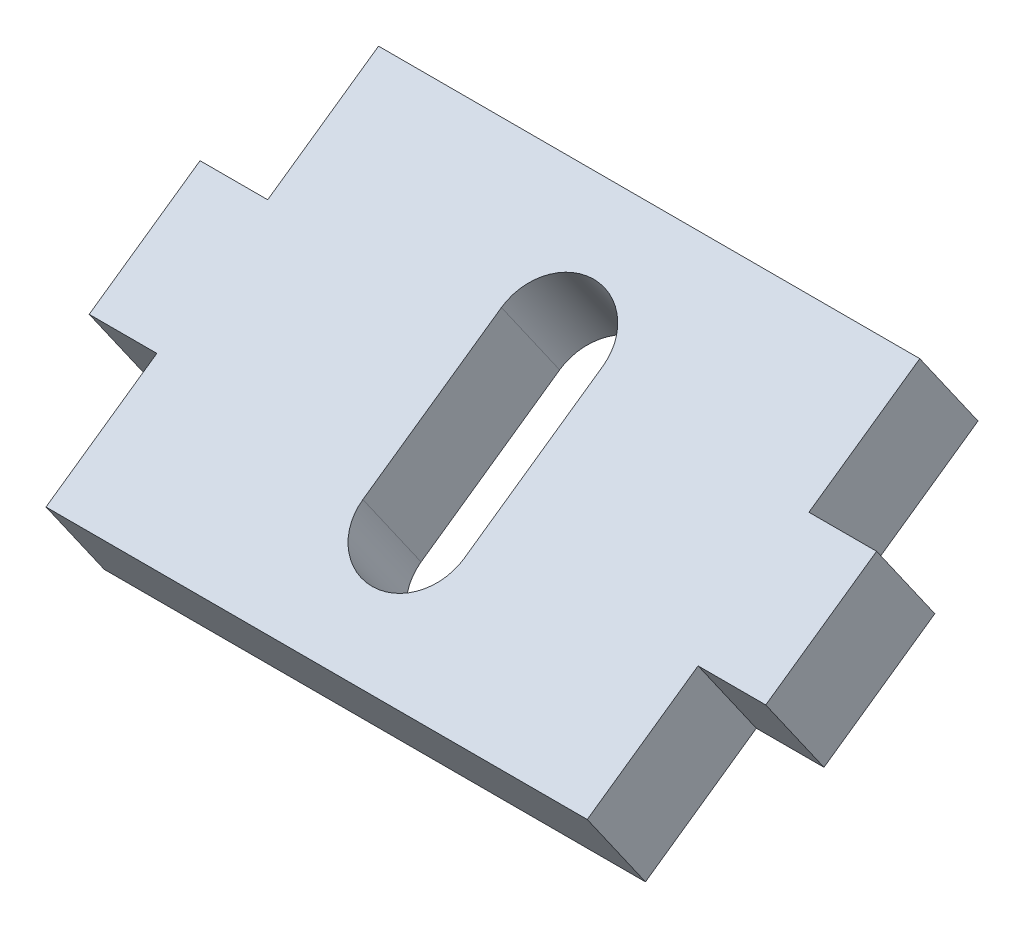
ISO-10303-21;
HEADER;
FILE_DESCRIPTION(('STEP AP214'),'2;1');
FILE_NAME('part.step','',(''),(''),'','','');
FILE_SCHEMA(('AUTOMOTIVE_DESIGN { 1 0 10303 214 1 1 1 1 }'));
ENDSEC;
DATA;
#1=APPLICATION_CONTEXT('core data for automotive mechanical design processes');
#2=APPLICATION_PROTOCOL_DEFINITION('international standard','automotive_design',2000,#1);
#3=PRODUCT_CONTEXT('',#1,'mechanical');
#4=PRODUCT('Part','Part','',(#3));
#5=PRODUCT_RELATED_PRODUCT_CATEGORY('part','',(#4));
#6=PRODUCT_DEFINITION_FORMATION('','',#4);
#7=PRODUCT_DEFINITION_CONTEXT('part definition',#1,'design');
#8=PRODUCT_DEFINITION('design','',#6,#7);
#9=PRODUCT_DEFINITION_SHAPE('','',#8);
#10=(LENGTH_UNIT() NAMED_UNIT(*) SI_UNIT(.MILLI.,.METRE.));
#11=(NAMED_UNIT(*) PLANE_ANGLE_UNIT() SI_UNIT($,.RADIAN.));
#12=(NAMED_UNIT(*) SI_UNIT($,.STERADIAN.) SOLID_ANGLE_UNIT());
#13=UNCERTAINTY_MEASURE_WITH_UNIT(LENGTH_MEASURE(1.E-05),#10,'distance_accuracy_value','');
#14=(GEOMETRIC_REPRESENTATION_CONTEXT(3) GLOBAL_UNCERTAINTY_ASSIGNED_CONTEXT((#13)) GLOBAL_UNIT_ASSIGNED_CONTEXT((#10,
#11,#12)) REPRESENTATION_CONTEXT('',''));
#15=CARTESIAN_POINT('',(0.,0.,0.));
#16=DIRECTION('',(0.,0.,1.));
#17=DIRECTION('',(1.,0.,0.));
#18=AXIS2_PLACEMENT_3D('',#15,#16,#17);
#19=CARTESIAN_POINT('',(40.,-6.14364033216738,-4.30182327263293));
#20=DIRECTION('',(-1.,0.,0.));
#21=DIRECTION('',(0.,0.,1.));
#22=AXIS2_PLACEMENT_3D('',#19,#20,#21);
#23=PLANE('',#22);
#24=DIRECTION('',(0.,0.819152044288984,0.573576436351057));
#25=VECTOR('',#24,1.);
#26=CARTESIAN_POINT('',(40.0000000000001,-24.8683128502051,-109.620726007886));
#27=LINE('',#26,#25);
#28=CARTESIAN_POINT('',(40.0000000000001,-6.55151630082419,-96.7951669881557));
#29=VERTEX_POINT('',#28);
#30=CARTESIAN_POINT('',(40.0000000000001,5.73576436351056,-88.1915204428899));
#31=VERTEX_POINT('',#30);
#32=EDGE_CURVE('E187',#29,#31,#27,.T.);
#33=ORIENTED_EDGE('',*,*,#32,.F.);
#34=DIRECTION('',(0.,0.573576436351057,-0.819152044288984));
#35=VECTOR('',#34,1.);
#36=CARTESIAN_POINT('',(40.,-29.4945737548668,-64.0290852165959));
#37=LINE('',#36,#35);
#38=CARTESIAN_POINT('',(40.,4.92001242619725,-113.178207873936));
#39=VERTEX_POINT('',#38);
#40=EDGE_CURVE('E279',#29,#39,#37,.T.);
#41=ORIENTED_EDGE('',*,*,#40,.T.);
#42=DIRECTION('',(0.,0.819152044288984,0.573576436351057));
#43=VECTOR('',#42,1.);
#44=CARTESIAN_POINT('',(40.,17.207293090532,-104.57456132867));
#45=LINE('',#44,#43);
#46=CARTESIAN_POINT('',(40.,17.207293090532,-104.57456132867));
#47=VERTEX_POINT('',#46);
#48=EDGE_CURVE('E285',#39,#47,#45,.T.);
#49=ORIENTED_EDGE('',*,*,#48,.T.);
#50=DIRECTION('',(0.,-0.573576436351057,0.819152044288984));
#51=VECTOR('',#50,1.);
#52=CARTESIAN_POINT('',(40.,-17.207293090532,-55.4254386713301));
#53=LINE('',#52,#51);
#54=EDGE_CURVE('E288',#47,#31,#53,.T.);
#55=ORIENTED_EDGE('',*,*,#54,.T.);
#56=EDGE_LOOP('',(#33,#41,#49,#55));
#57=FACE_BOUND('',#56,.T.);
#58=ADVANCED_FACE('F38',(#57),#23,.F.);
#59=CARTESIAN_POINT('',(-40.,-6.14364033216738,-4.30182327263293));
#60=DIRECTION('',(-1.,0.,0.));
#61=DIRECTION('',(0.,0.,1.));
#62=AXIS2_PLACEMENT_3D('',#59,#60,#61);
#63=PLANE('',#62);
#64=DIRECTION('',(0.,0.573576436351057,-0.819152044288984));
#65=VECTOR('',#64,1.);
#66=CARTESIAN_POINT('',(-40.,-29.4945737548668,-64.0290852165959));
#67=LINE('',#66,#65);
#68=CARTESIAN_POINT('',(-40.,-6.55151630082419,-96.7951669881557));
#69=VERTEX_POINT('',#68);
#70=CARTESIAN_POINT('',(-40.,4.92001242619725,-113.178207873936));
#71=VERTEX_POINT('',#70);
#72=EDGE_CURVE('E62',#69,#71,#67,.T.);
#73=ORIENTED_EDGE('',*,*,#72,.F.);
#74=DIRECTION('',(0.,0.819152044288984,0.573576436351057));
#75=VECTOR('',#74,1.);
#76=CARTESIAN_POINT('',(-40.0000000000001,-24.8683128502051,-109.620726007886));
#77=LINE('',#76,#75);
#78=CARTESIAN_POINT('',(-40.,5.73576436351057,-88.1915204428899));
#79=VERTEX_POINT('',#78);
#80=EDGE_CURVE('E217',#69,#79,#77,.T.);
#81=ORIENTED_EDGE('',*,*,#80,.T.);
#82=DIRECTION('',(0.,-0.573576436351057,0.819152044288984));
#83=VECTOR('',#82,1.);
#84=CARTESIAN_POINT('',(-40.,-17.207293090532,-55.4254386713301));
#85=LINE('',#84,#83);
#86=CARTESIAN_POINT('',(-40.,17.207293090532,-104.57456132867));
#87=VERTEX_POINT('',#86);
#88=EDGE_CURVE('E280',#87,#79,#85,.T.);
#89=ORIENTED_EDGE('',*,*,#88,.F.);
#90=DIRECTION('',(0.,0.819152044288984,0.573576436351057));
#91=VECTOR('',#90,1.);
#92=CARTESIAN_POINT('',(-40.,17.207293090532,-104.57456132867));
#93=LINE('',#92,#91);
#94=EDGE_CURVE('E300',#71,#87,#93,.T.);
#95=ORIENTED_EDGE('',*,*,#94,.F.);
#96=EDGE_LOOP('',(#73,#81,#89,#95));
#97=FACE_BOUND('',#96,.T.);
#98=ADVANCED_FACE('F324',(#97),#63,.T.);
#99=CARTESIAN_POINT('',(40.,-29.4945737548668,-64.0290852165959));
#100=DIRECTION('',(0.,0.573576436351057,-0.819152044288984));
#101=DIRECTION('',(0.,0.819152044288984,0.573576436351057));
#102=AXIS2_PLACEMENT_3D('',#99,#100,#101);
#103=PLANE('',#102);
#104=DIRECTION('',(0.,-0.819152044288984,-0.573576436351057));
#105=VECTOR('',#104,1.);
#106=CARTESIAN_POINT('',(-40.,-29.4945737548668,-64.0290852165959));
#107=LINE('',#106,#105);
#108=CARTESIAN_POINT('',(-40.,-17.207293090532,-55.4254386713301));
#109=VERTEX_POINT('',#108);
#110=CARTESIAN_POINT('',(-40.,-29.4945737548668,-64.0290852165959));
#111=VERTEX_POINT('',#110);
#112=EDGE_CURVE('E274',#109,#111,#107,.T.);
#113=ORIENTED_EDGE('',*,*,#112,.T.);
#114=DIRECTION('',(-1.,0.,0.));
#115=VECTOR('',#114,1.);
#116=CARTESIAN_POINT('',(40.,-29.4945737548668,-64.0290852165959));
#117=LINE('',#116,#115);
#118=CARTESIAN_POINT('',(40.,-29.4945737548668,-64.0290852165959));
#119=VERTEX_POINT('',#118);
#120=EDGE_CURVE('E11',#119,#111,#117,.T.);
#121=ORIENTED_EDGE('',*,*,#120,.F.);
#122=DIRECTION('',(0.,-0.819152044288984,-0.573576436351057));
#123=VECTOR('',#122,1.);
#124=CARTESIAN_POINT('',(40.,-29.4945737548668,-64.0290852165959));
#125=LINE('',#124,#123);
#126=CARTESIAN_POINT('',(40.,-17.207293090532,-55.4254386713301));
#127=VERTEX_POINT('',#126);
#128=EDGE_CURVE('E275',#127,#119,#125,.T.);
#129=ORIENTED_EDGE('',*,*,#128,.F.);
#130=DIRECTION('',(-1.,0.,0.));
#131=VECTOR('',#130,1.);
#132=CARTESIAN_POINT('',(40.,-17.207293090532,-55.4254386713301));
#133=LINE('',#132,#131);
#134=EDGE_CURVE('E292',#127,#109,#133,.T.);
#135=ORIENTED_EDGE('',*,*,#134,.T.);
#136=EDGE_LOOP('',(#113,#121,#129,#135));
#137=FACE_BOUND('',#136,.T.);
#138=ADVANCED_FACE('F40',(#137),#103,.F.);
#139=CARTESIAN_POINT('',(40.,-29.4945737548668,-64.0290852165959));
#140=DIRECTION('',(0.,0.819152044288984,0.573576436351057));
#141=DIRECTION('',(0.,-0.573576436351057,0.819152044288984));
#142=AXIS2_PLACEMENT_3D('',#139,#140,#141);
#143=PLANE('',#142);
#144=DIRECTION('',(0.,-0.573576436351057,0.819152044288984));
#145=VECTOR('',#144,1.);
#146=CARTESIAN_POINT('',(7.5,-5.11757520994656,-98.8430470988782));
#147=LINE('',#146,#145);
#148=CARTESIAN_POINT('',(7.5,-5.11757520994654,-98.8430470988782));
#149=VERTEX_POINT('',#148);
#150=CARTESIAN_POINT('',(7.5,-19.456986118723,-78.3642459916536));
#151=VERTEX_POINT('',#150);
#152=EDGE_CURVE('E245',#149,#151,#147,.T.);
#153=ORIENTED_EDGE('',*,*,#152,.F.);
#154=CARTESIAN_POINT('',(0.,-5.11757520994656,-98.8430470988782));
#155=DIRECTION('',(0.,-0.819152044288984,-0.573576436351057));
#156=DIRECTION('',(0.,0.573576436351057,-0.819152044288984));
#157=AXIS2_PLACEMENT_3D('',#154,#155,#156);
#158=CIRCLE('',#157,7.5);
#159=CARTESIAN_POINT('',(-7.5,-5.11757520994656,-98.8430470988782));
#160=VERTEX_POINT('',#159);
#161=EDGE_CURVE('E242',#160,#149,#158,.T.);
#162=ORIENTED_EDGE('',*,*,#161,.F.);
#163=DIRECTION('',(0.,0.573576436351057,-0.819152044288984));
#164=VECTOR('',#163,1.);
#165=CARTESIAN_POINT('',(-7.5,-5.11757520994656,-98.8430470988782));
#166=LINE('',#165,#164);
#167=CARTESIAN_POINT('',(-7.5,-19.456986118723,-78.3642459916536));
#168=VERTEX_POINT('',#167);
#169=EDGE_CURVE('E253',#168,#160,#166,.T.);
#170=ORIENTED_EDGE('',*,*,#169,.F.);
#171=CARTESIAN_POINT('',(0.,-19.456986118723,-78.3642459916536));
#172=DIRECTION('',(0.,-0.819152044288984,-0.573576436351057));
#173=DIRECTION('',(0.,0.573576436351057,-0.819152044288984));
#174=AXIS2_PLACEMENT_3D('',#171,#172,#173);
#175=CIRCLE('',#174,7.5);
#176=EDGE_CURVE('E249',#151,#168,#175,.T.);
#177=ORIENTED_EDGE('',*,*,#176,.F.);
#178=EDGE_LOOP('',(#153,#162,#170,#177));
#179=FACE_BOUND('',#178,.T.);
#180=CARTESIAN_POINT('',(-40.,-18.0230450278453,-80.412126102376));
#181=VERTEX_POINT('',#180);
#182=EDGE_CURVE('E296',#111,#181,#67,.T.);
#183=ORIENTED_EDGE('',*,*,#182,.T.);
#184=DIRECTION('',(-1.,0.,0.));
#185=VECTOR('',#184,1.);
#186=CARTESIAN_POINT('',(-40.0000000000001,-18.0230450278453,-80.412126102376));
#187=LINE('',#186,#185);
#188=CARTESIAN_POINT('',(-50.,-18.0230450278453,-80.412126102376));
#189=VERTEX_POINT('',#188);
#190=EDGE_CURVE('E200',#181,#189,#187,.T.);
#191=ORIENTED_EDGE('',*,*,#190,.T.);
#192=DIRECTION('',(0.,0.573576436351057,-0.819152044288984));
#193=VECTOR('',#192,1.);
#194=CARTESIAN_POINT('',(-50.,-6.55151630082419,-96.7951669881557));
#195=LINE('',#194,#193);
#196=CARTESIAN_POINT('',(-50.,-6.55151630082419,-96.7951669881557));
#197=VERTEX_POINT('',#196);
#198=EDGE_CURVE('E197',#189,#197,#195,.T.);
#199=ORIENTED_EDGE('',*,*,#198,.T.);
#200=DIRECTION('',(1.,0.,0.));
#201=VECTOR('',#200,1.);
#202=CARTESIAN_POINT('',(-40.0000000000001,-6.55151630082419,-96.7951669881557));
#203=LINE('',#202,#201);
#204=EDGE_CURVE('E204',#197,#69,#203,.T.);
#205=ORIENTED_EDGE('',*,*,#204,.T.);
#206=ORIENTED_EDGE('',*,*,#72,.T.);
#207=DIRECTION('',(-1.,0.,0.));
#208=VECTOR('',#207,1.);
#209=CARTESIAN_POINT('',(40.,4.92001242619725,-113.178207873936));
#210=LINE('',#209,#208);
#211=EDGE_CURVE('E47',#39,#71,#210,.T.);
#212=ORIENTED_EDGE('',*,*,#211,.F.);
#213=ORIENTED_EDGE('',*,*,#40,.F.);
#214=DIRECTION('',(-1.,0.,0.));
#215=VECTOR('',#214,1.);
#216=CARTESIAN_POINT('',(40.0000000000001,-6.55151630082419,-96.7951669881557));
#217=LINE('',#216,#215);
#218=CARTESIAN_POINT('',(50.,-6.55151630082419,-96.7951669881557));
#219=VERTEX_POINT('',#218);
#220=EDGE_CURVE('E182',#219,#29,#217,.T.);
#221=ORIENTED_EDGE('',*,*,#220,.F.);
#222=DIRECTION('',(0.,0.573576436351057,-0.819152044288984));
#223=VECTOR('',#222,1.);
#224=CARTESIAN_POINT('',(50.,-6.55151630082419,-96.7951669881557));
#225=LINE('',#224,#223);
#226=CARTESIAN_POINT('',(50.,-18.0230450278453,-80.412126102376));
#227=VERTEX_POINT('',#226);
#228=EDGE_CURVE('E196',#227,#219,#225,.T.);
#229=ORIENTED_EDGE('',*,*,#228,.F.);
#230=DIRECTION('',(1.,0.,0.));
#231=VECTOR('',#230,1.);
#232=CARTESIAN_POINT('',(40.0000000000001,-18.0230450278453,-80.412126102376));
#233=LINE('',#232,#231);
#234=CARTESIAN_POINT('',(40.0000000000001,-18.0230450278453,-80.412126102376));
#235=VERTEX_POINT('',#234);
#236=EDGE_CURVE('E155',#235,#227,#233,.T.);
#237=ORIENTED_EDGE('',*,*,#236,.F.);
#238=EDGE_CURVE('E281',#119,#235,#37,.T.);
#239=ORIENTED_EDGE('',*,*,#238,.F.);
#240=ORIENTED_EDGE('',*,*,#120,.T.);
#241=EDGE_LOOP('',(#183,#191,#199,#205,#206,#212,#213,#221,#229,#237,#239,#240));
#242=FACE_BOUND('',#241,.T.);
#243=ADVANCED_FACE('F344',(#179,#242),#143,.F.);
#244=CARTESIAN_POINT('',(40.,17.207293090532,-104.57456132867));
#245=DIRECTION('',(0.,-0.573576436351057,0.819152044288984));
#246=DIRECTION('',(0.,-0.819152044288984,-0.573576436351057));
#247=AXIS2_PLACEMENT_3D('',#244,#245,#246);
#248=PLANE('',#247);
#249=ORIENTED_EDGE('',*,*,#94,.T.);
#250=DIRECTION('',(-1.,0.,0.));
#251=VECTOR('',#250,1.);
#252=CARTESIAN_POINT('',(40.,17.207293090532,-104.57456132867));
#253=LINE('',#252,#251);
#254=EDGE_CURVE('E309',#47,#87,#253,.T.);
#255=ORIENTED_EDGE('',*,*,#254,.F.);
#256=ORIENTED_EDGE('',*,*,#48,.F.);
#257=ORIENTED_EDGE('',*,*,#211,.T.);
#258=EDGE_LOOP('',(#249,#255,#256,#257));
#259=FACE_BOUND('',#258,.T.);
#260=ADVANCED_FACE('F319',(#259),#248,.F.);
#261=CARTESIAN_POINT('',(40.,-17.207293090532,-55.4254386713301));
#262=DIRECTION('',(0.,-0.819152044288984,-0.573576436351057));
#263=DIRECTION('',(0.,0.573576436351057,-0.819152044288984));
#264=AXIS2_PLACEMENT_3D('',#261,#262,#263);
#265=PLANE('',#264);
#266=DIRECTION('',(0.,-0.573576436351057,0.819152044288984));
#267=VECTOR('',#266,1.);
#268=CARTESIAN_POINT('',(-7.5,7.16970545438822,-90.2394005536123));
#269=LINE('',#268,#267);
#270=CARTESIAN_POINT('',(-7.5,7.1697054543882,-90.2394005536123));
#271=VERTEX_POINT('',#270);
#272=CARTESIAN_POINT('',(-7.5,-7.16970545438825,-69.7605994463878));
#273=VERTEX_POINT('',#272);
#274=EDGE_CURVE('E234',#271,#273,#269,.T.);
#275=ORIENTED_EDGE('',*,*,#274,.F.);
#276=CARTESIAN_POINT('',(0.,7.16970545438819,-90.2394005536123));
#277=DIRECTION('',(0.,-0.819152044288984,-0.573576436351057));
#278=DIRECTION('',(0.,0.573576436351057,-0.819152044288984));
#279=AXIS2_PLACEMENT_3D('',#276,#277,#278);
#280=CIRCLE('',#279,7.5);
#281=CARTESIAN_POINT('',(7.5,7.1697054543882,-90.2394005536123));
#282=VERTEX_POINT('',#281);
#283=EDGE_CURVE('E238',#282,#271,#280,.F.);
#284=ORIENTED_EDGE('',*,*,#283,.F.);
#285=DIRECTION('',(0.,0.573576436351057,-0.819152044288984));
#286=VECTOR('',#285,1.);
#287=CARTESIAN_POINT('',(7.5,7.16970545438822,-90.2394005536123));
#288=LINE('',#287,#286);
#289=CARTESIAN_POINT('',(7.5,-7.16970545438821,-69.7605994463877));
#290=VERTEX_POINT('',#289);
#291=EDGE_CURVE('E261',#290,#282,#288,.T.);
#292=ORIENTED_EDGE('',*,*,#291,.F.);
#293=CARTESIAN_POINT('',(0.,-7.16970545438822,-69.7605994463877));
#294=DIRECTION('',(0.,-0.819152044288984,-0.573576436351057));
#295=DIRECTION('',(0.,0.573576436351057,-0.819152044288984));
#296=AXIS2_PLACEMENT_3D('',#293,#294,#295);
#297=CIRCLE('',#296,7.5);
#298=EDGE_CURVE('E231',#273,#290,#297,.F.);
#299=ORIENTED_EDGE('',*,*,#298,.F.);
#300=EDGE_LOOP('',(#275,#284,#292,#299));
#301=FACE_BOUND('',#300,.T.);
#302=ORIENTED_EDGE('',*,*,#88,.T.);
#303=DIRECTION('',(-1.,0.,0.));
#304=VECTOR('',#303,1.);
#305=CARTESIAN_POINT('',(-40.0000000000001,5.73576436351056,-88.1915204428899));
#306=LINE('',#305,#304);
#307=CARTESIAN_POINT('',(-50.,5.73576436351056,-88.1915204428899));
#308=VERTEX_POINT('',#307);
#309=EDGE_CURVE('E205',#79,#308,#306,.T.);
#310=ORIENTED_EDGE('',*,*,#309,.T.);
#311=DIRECTION('',(0.,-0.573576436351057,0.819152044288984));
#312=VECTOR('',#311,1.);
#313=CARTESIAN_POINT('',(-50.,5.73576436351056,-88.1915204428899));
#314=LINE('',#313,#312);
#315=CARTESIAN_POINT('',(-50.,-5.73576436351057,-71.8084795571102));
#316=VERTEX_POINT('',#315);
#317=EDGE_CURVE('E209',#308,#316,#314,.T.);
#318=ORIENTED_EDGE('',*,*,#317,.T.);
#319=DIRECTION('',(1.,0.,0.));
#320=VECTOR('',#319,1.);
#321=CARTESIAN_POINT('',(-40.0000000000001,-5.73576436351057,-71.8084795571102));
#322=LINE('',#321,#320);
#323=CARTESIAN_POINT('',(-40.0000000000001,-5.73576436351057,-71.8084795571102));
#324=VERTEX_POINT('',#323);
#325=EDGE_CURVE('E213',#316,#324,#322,.T.);
#326=ORIENTED_EDGE('',*,*,#325,.T.);
#327=EDGE_CURVE('E303',#324,#109,#85,.T.);
#328=ORIENTED_EDGE('',*,*,#327,.T.);
#329=ORIENTED_EDGE('',*,*,#134,.F.);
#330=CARTESIAN_POINT('',(40.,-5.73576436351057,-71.8084795571102));
#331=VERTEX_POINT('',#330);
#332=EDGE_CURVE('E176',#331,#127,#53,.T.);
#333=ORIENTED_EDGE('',*,*,#332,.F.);
#334=DIRECTION('',(-1.,0.,0.));
#335=VECTOR('',#334,1.);
#336=CARTESIAN_POINT('',(40.0000000000001,-5.73576436351057,-71.8084795571102));
#337=LINE('',#336,#335);
#338=CARTESIAN_POINT('',(50.,-5.73576436351057,-71.8084795571102));
#339=VERTEX_POINT('',#338);
#340=EDGE_CURVE('E54',#339,#331,#337,.T.);
#341=ORIENTED_EDGE('',*,*,#340,.F.);
#342=DIRECTION('',(0.,-0.573576436351057,0.819152044288984));
#343=VECTOR('',#342,1.);
#344=CARTESIAN_POINT('',(50.,5.73576436351056,-88.1915204428899));
#345=LINE('',#344,#343);
#346=CARTESIAN_POINT('',(50.,5.73576436351056,-88.1915204428899));
#347=VERTEX_POINT('',#346);
#348=EDGE_CURVE('E163',#347,#339,#345,.T.);
#349=ORIENTED_EDGE('',*,*,#348,.F.);
#350=DIRECTION('',(1.,0.,0.));
#351=VECTOR('',#350,1.);
#352=CARTESIAN_POINT('',(40.0000000000001,5.73576436351056,-88.1915204428899));
#353=LINE('',#352,#351);
#354=EDGE_CURVE('E170',#31,#347,#353,.T.);
#355=ORIENTED_EDGE('',*,*,#354,.F.);
#356=ORIENTED_EDGE('',*,*,#54,.F.);
#357=ORIENTED_EDGE('',*,*,#254,.T.);
#358=EDGE_LOOP('',(#302,#310,#318,#326,#328,#329,#333,#341,#349,#355,#356,#357));
#359=FACE_BOUND('',#358,.T.);
#360=ADVANCED_FACE('F174',(#301,#359),#265,.F.);
#361=ORIENTED_EDGE('',*,*,#238,.T.);
#362=DIRECTION('',(0.,0.819152044288984,0.573576436351057));
#363=VECTOR('',#362,1.);
#364=CARTESIAN_POINT('',(40.0000000000001,-36.3398415772262,-93.2376851221065));
#365=LINE('',#364,#363);
#366=EDGE_CURVE('E160',#235,#331,#365,.T.);
#367=ORIENTED_EDGE('',*,*,#366,.T.);
#368=ORIENTED_EDGE('',*,*,#332,.T.);
#369=ORIENTED_EDGE('',*,*,#128,.T.);
#370=EDGE_LOOP('',(#361,#367,#368,#369));
#371=FACE_BOUND('',#370,.T.);
#372=ADVANCED_FACE('F353',(#371),#23,.F.);
#373=DIRECTION('',(0.,0.819152044288984,0.573576436351057));
#374=VECTOR('',#373,1.);
#375=CARTESIAN_POINT('',(-40.0000000000001,-36.3398415772262,-93.2376851221065));
#376=LINE('',#375,#374);
#377=EDGE_CURVE('E201',#181,#324,#376,.T.);
#378=ORIENTED_EDGE('',*,*,#377,.F.);
#379=ORIENTED_EDGE('',*,*,#182,.F.);
#380=ORIENTED_EDGE('',*,*,#112,.F.);
#381=ORIENTED_EDGE('',*,*,#327,.F.);
#382=EDGE_LOOP('',(#378,#379,#380,#381));
#383=FACE_BOUND('',#382,.T.);
#384=ADVANCED_FACE('F342',(#383),#63,.T.);
#385=CARTESIAN_POINT('',(0.,147.11195761086,7.74921932039585));
#386=DIRECTION('',(0.,-0.819152044288984,-0.573576436351057));
#387=DIRECTION('',(0.,0.573576436351057,-0.819152044288984));
#388=AXIS2_PLACEMENT_3D('',#385,#386,#387);
#389=CYLINDRICAL_SURFACE('',#388,7.5);
#390=ORIENTED_EDGE('',*,*,#283,.T.);
#391=DIRECTION('',(0.,-0.819152044288984,-0.573576436351057));
#392=VECTOR('',#391,1.);
#393=CARTESIAN_POINT('',(-7.5,147.11195761086,7.74921932039585));
#394=LINE('',#393,#392);
#395=EDGE_CURVE('E258',#271,#160,#394,.T.);
#396=ORIENTED_EDGE('',*,*,#395,.T.);
#397=ORIENTED_EDGE('',*,*,#161,.T.);
#398=DIRECTION('',(0.,-0.819152044288984,-0.573576436351057));
#399=VECTOR('',#398,1.);
#400=CARTESIAN_POINT('',(7.5,147.11195761086,7.74921932039585));
#401=LINE('',#400,#399);
#402=EDGE_CURVE('E257',#282,#149,#401,.T.);
#403=ORIENTED_EDGE('',*,*,#402,.F.);
#404=EDGE_LOOP('',(#390,#396,#397,#403));
#405=FACE_BOUND('',#404,.T.);
#406=ADVANCED_FACE('F361',(#405),#389,.F.);
#407=CARTESIAN_POINT('',(-7.5,147.11195761086,7.74921932039585));
#408=DIRECTION('',(-1.,0.,0.));
#409=DIRECTION('',(0.,0.,1.));
#410=AXIS2_PLACEMENT_3D('',#407,#408,#409);
#411=PLANE('',#410);
#412=ORIENTED_EDGE('',*,*,#274,.T.);
#413=DIRECTION('',(0.,-0.819152044288984,-0.573576436351057));
#414=VECTOR('',#413,1.);
#415=CARTESIAN_POINT('',(-7.5,132.772546702083,28.2280204276204));
#416=LINE('',#415,#414);
#417=EDGE_CURVE('E262',#273,#168,#416,.T.);
#418=ORIENTED_EDGE('',*,*,#417,.T.);
#419=ORIENTED_EDGE('',*,*,#169,.T.);
#420=ORIENTED_EDGE('',*,*,#395,.F.);
#421=EDGE_LOOP('',(#412,#418,#419,#420));
#422=FACE_BOUND('',#421,.T.);
#423=ADVANCED_FACE('F426',(#422),#411,.F.);
#424=CARTESIAN_POINT('',(0.,132.772546702083,28.2280204276204));
#425=DIRECTION('',(0.,-0.819152044288984,-0.573576436351057));
#426=DIRECTION('',(0.,0.573576436351057,-0.819152044288984));
#427=AXIS2_PLACEMENT_3D('',#424,#425,#426);
#428=CYLINDRICAL_SURFACE('',#427,7.5);
#429=ORIENTED_EDGE('',*,*,#298,.T.);
#430=DIRECTION('',(0.,-0.819152044288984,-0.573576436351057));
#431=VECTOR('',#430,1.);
#432=CARTESIAN_POINT('',(7.5,132.772546702083,28.2280204276205));
#433=LINE('',#432,#431);
#434=EDGE_CURVE('E265',#290,#151,#433,.T.);
#435=ORIENTED_EDGE('',*,*,#434,.T.);
#436=ORIENTED_EDGE('',*,*,#176,.T.);
#437=ORIENTED_EDGE('',*,*,#417,.F.);
#438=EDGE_LOOP('',(#429,#435,#436,#437));
#439=FACE_BOUND('',#438,.T.);
#440=ADVANCED_FACE('F429',(#439),#428,.F.);
#441=CARTESIAN_POINT('',(7.5,147.11195761086,7.74921932039585));
#442=DIRECTION('',(1.,0.,0.));
#443=DIRECTION('',(0.,0.,-1.));
#444=AXIS2_PLACEMENT_3D('',#441,#442,#443);
#445=PLANE('',#444);
#446=ORIENTED_EDGE('',*,*,#291,.T.);
#447=ORIENTED_EDGE('',*,*,#402,.T.);
#448=ORIENTED_EDGE('',*,*,#152,.T.);
#449=ORIENTED_EDGE('',*,*,#434,.F.);
#450=EDGE_LOOP('',(#446,#447,#448,#449));
#451=FACE_BOUND('',#450,.T.);
#452=ADVANCED_FACE('F421',(#451),#445,.F.);
#453=CARTESIAN_POINT('',(-40.0000000000001,-36.3398415772262,-93.2376851221065));
#454=DIRECTION('',(0.,-0.573576436351057,0.819152044288984));
#455=DIRECTION('',(0.,-0.819152044288984,-0.573576436351057));
#456=AXIS2_PLACEMENT_3D('',#453,#454,#455);
#457=PLANE('',#456);
#458=ORIENTED_EDGE('',*,*,#190,.F.);
#459=ORIENTED_EDGE('',*,*,#377,.T.);
#460=ORIENTED_EDGE('',*,*,#325,.F.);
#461=DIRECTION('',(0.,0.819152044288984,0.573576436351057));
#462=VECTOR('',#461,1.);
#463=CARTESIAN_POINT('',(-50.,-36.3398415772262,-93.2376851221065));
#464=LINE('',#463,#462);
#465=EDGE_CURVE('E221',#189,#316,#464,.T.);
#466=ORIENTED_EDGE('',*,*,#465,.F.);
#467=EDGE_LOOP('',(#458,#459,#460,#466));
#468=FACE_BOUND('',#467,.T.);
#469=ADVANCED_FACE('F340',(#468),#457,.T.);
#470=CARTESIAN_POINT('',(-50.,-24.8683128502051,-109.620726007886));
#471=DIRECTION('',(-1.,0.,0.));
#472=DIRECTION('',(0.,0.,1.));
#473=AXIS2_PLACEMENT_3D('',#470,#471,#472);
#474=PLANE('',#473);
#475=ORIENTED_EDGE('',*,*,#198,.F.);
#476=ORIENTED_EDGE('',*,*,#465,.T.);
#477=ORIENTED_EDGE('',*,*,#317,.F.);
#478=DIRECTION('',(0.,0.819152044288984,0.573576436351057));
#479=VECTOR('',#478,1.);
#480=CARTESIAN_POINT('',(-50.,-24.8683128502051,-109.620726007886));
#481=LINE('',#480,#479);
#482=EDGE_CURVE('E224',#197,#308,#481,.T.);
#483=ORIENTED_EDGE('',*,*,#482,.F.);
#484=EDGE_LOOP('',(#475,#476,#477,#483));
#485=FACE_BOUND('',#484,.T.);
#486=ADVANCED_FACE('F335',(#485),#474,.T.);
#487=CARTESIAN_POINT('',(-40.0000000000001,-24.8683128502051,-109.620726007886));
#488=DIRECTION('',(0.,0.573576436351057,-0.819152044288984));
#489=DIRECTION('',(0.,0.819152044288984,0.573576436351057));
#490=AXIS2_PLACEMENT_3D('',#487,#488,#489);
#491=PLANE('',#490);
#492=ORIENTED_EDGE('',*,*,#204,.F.);
#493=ORIENTED_EDGE('',*,*,#482,.T.);
#494=ORIENTED_EDGE('',*,*,#309,.F.);
#495=ORIENTED_EDGE('',*,*,#80,.F.);
#496=EDGE_LOOP('',(#492,#493,#494,#495));
#497=FACE_BOUND('',#496,.T.);
#498=ADVANCED_FACE('F330',(#497),#491,.T.);
#499=CARTESIAN_POINT('',(40.0000000000001,-36.3398415772262,-93.2376851221065));
#500=DIRECTION('',(0.,0.573576436351057,-0.819152044288984));
#501=DIRECTION('',(0.,0.819152044288984,0.573576436351057));
#502=AXIS2_PLACEMENT_3D('',#499,#500,#501);
#503=PLANE('',#502);
#504=ORIENTED_EDGE('',*,*,#366,.F.);
#505=ORIENTED_EDGE('',*,*,#236,.T.);
#506=DIRECTION('',(0.,0.819152044288984,0.573576436351057));
#507=VECTOR('',#506,1.);
#508=CARTESIAN_POINT('',(50.,-36.3398415772262,-93.2376851221065));
#509=LINE('',#508,#507);
#510=EDGE_CURVE('E152',#227,#339,#509,.T.);
#511=ORIENTED_EDGE('',*,*,#510,.T.);
#512=ORIENTED_EDGE('',*,*,#340,.T.);
#513=EDGE_LOOP('',(#504,#505,#511,#512));
#514=FACE_BOUND('',#513,.T.);
#515=ADVANCED_FACE('F154',(#514),#503,.F.);
#516=CARTESIAN_POINT('',(50.,-24.8683128502051,-109.620726007886));
#517=DIRECTION('',(-1.,0.,0.));
#518=DIRECTION('',(0.,0.,1.));
#519=AXIS2_PLACEMENT_3D('',#516,#517,#518);
#520=PLANE('',#519);
#521=ORIENTED_EDGE('',*,*,#510,.F.);
#522=ORIENTED_EDGE('',*,*,#228,.T.);
#523=DIRECTION('',(0.,0.819152044288984,0.573576436351057));
#524=VECTOR('',#523,1.);
#525=CARTESIAN_POINT('',(50.,-24.8683128502051,-109.620726007886));
#526=LINE('',#525,#524);
#527=EDGE_CURVE('E159',#219,#347,#526,.T.);
#528=ORIENTED_EDGE('',*,*,#527,.T.);
#529=ORIENTED_EDGE('',*,*,#348,.T.);
#530=EDGE_LOOP('',(#521,#522,#528,#529));
#531=FACE_BOUND('',#530,.T.);
#532=ADVANCED_FACE('F164',(#531),#520,.F.);
#533=CARTESIAN_POINT('',(40.0000000000001,-24.8683128502051,-109.620726007886));
#534=DIRECTION('',(0.,-0.573576436351057,0.819152044288984));
#535=DIRECTION('',(0.,-0.819152044288984,-0.573576436351057));
#536=AXIS2_PLACEMENT_3D('',#533,#534,#535);
#537=PLANE('',#536);
#538=ORIENTED_EDGE('',*,*,#527,.F.);
#539=ORIENTED_EDGE('',*,*,#220,.T.);
#540=ORIENTED_EDGE('',*,*,#32,.T.);
#541=ORIENTED_EDGE('',*,*,#354,.T.);
#542=EDGE_LOOP('',(#538,#539,#540,#541));
#543=FACE_BOUND('',#542,.T.);
#544=ADVANCED_FACE('F396',(#543),#537,.F.);
#545=CLOSED_SHELL('',(#58,#98,#138,#243,#260,#360,#372,#384,#406,#423,#440,#452,#469,#486,#498,
#515,#532,#544));
#546=MANIFOLD_SOLID_BREP('B2',#545);
#547=ADVANCED_BREP_SHAPE_REPRESENTATION('',(#18,#546),#14);
#548=SHAPE_DEFINITION_REPRESENTATION(#9,#547);
ENDSEC;
END-ISO-10303-21;
